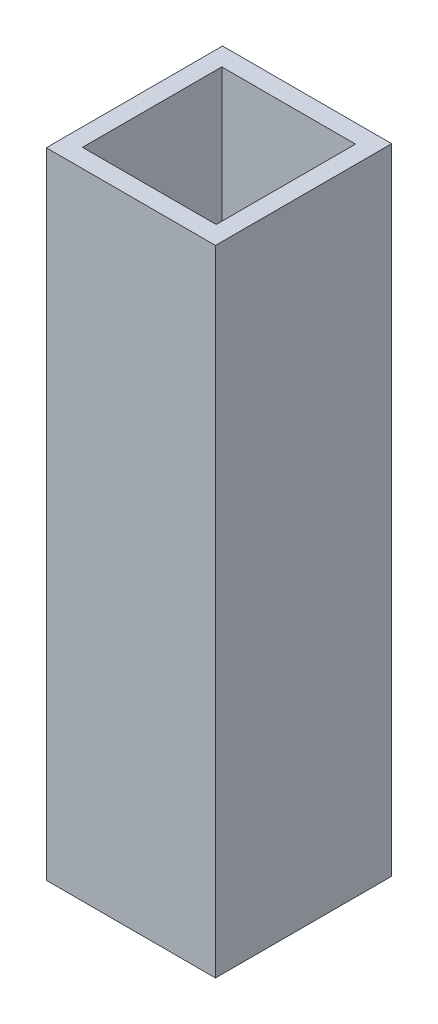
ISO-10303-21;
HEADER;
FILE_DESCRIPTION(('STEP AP214'),'2;1');
FILE_NAME('part.step','',(''),(''),'','','');
FILE_SCHEMA(('AUTOMOTIVE_DESIGN { 1 0 10303 214 1 1 1 1 }'));
ENDSEC;
DATA;
#1=APPLICATION_CONTEXT('core data for automotive mechanical design processes');
#2=APPLICATION_PROTOCOL_DEFINITION('international standard','automotive_design',2000,#1);
#3=PRODUCT_CONTEXT('',#1,'mechanical');
#4=PRODUCT('Part','Part','',(#3));
#5=PRODUCT_RELATED_PRODUCT_CATEGORY('part','',(#4));
#6=PRODUCT_DEFINITION_FORMATION('','',#4);
#7=PRODUCT_DEFINITION_CONTEXT('part definition',#1,'design');
#8=PRODUCT_DEFINITION('design','',#6,#7);
#9=PRODUCT_DEFINITION_SHAPE('','',#8);
#10=(LENGTH_UNIT() NAMED_UNIT(*) SI_UNIT(.MILLI.,.METRE.));
#11=(NAMED_UNIT(*) PLANE_ANGLE_UNIT() SI_UNIT($,.RADIAN.));
#12=(NAMED_UNIT(*) SI_UNIT($,.STERADIAN.) SOLID_ANGLE_UNIT());
#13=UNCERTAINTY_MEASURE_WITH_UNIT(LENGTH_MEASURE(1.E-05),#10,'distance_accuracy_value','');
#14=(GEOMETRIC_REPRESENTATION_CONTEXT(3) GLOBAL_UNCERTAINTY_ASSIGNED_CONTEXT((#13)) GLOBAL_UNIT_ASSIGNED_CONTEXT((#10,
#11,#12)) REPRESENTATION_CONTEXT('',''));
#15=CARTESIAN_POINT('',(0.,0.,0.));
#16=DIRECTION('',(0.,0.,1.));
#17=DIRECTION('',(1.,0.,0.));
#18=AXIS2_PLACEMENT_3D('',#15,#16,#17);
#19=CARTESIAN_POINT('',(0.,45.,0.));
#20=DIRECTION('',(0.,-1.,0.));
#21=DIRECTION('',(0.,0.,-1.));
#22=AXIS2_PLACEMENT_3D('',#19,#20,#21);
#23=PLANE('',#22);
#24=DIRECTION('',(0.,0.,-1.));
#25=VECTOR('',#24,1.);
#26=CARTESIAN_POINT('',(6.,45.,6.25));
#27=LINE('',#26,#25);
#28=CARTESIAN_POINT('',(6.,45.,6.25));
#29=VERTEX_POINT('',#28);
#30=CARTESIAN_POINT('',(6.,45.,-6.25));
#31=VERTEX_POINT('',#30);
#32=EDGE_CURVE('E143',#29,#31,#27,.T.);
#33=ORIENTED_EDGE('',*,*,#32,.T.);
#34=DIRECTION('',(-1.,0.,0.));
#35=VECTOR('',#34,1.);
#36=CARTESIAN_POINT('',(-6.,45.,-6.25));
#37=LINE('',#36,#35);
#38=CARTESIAN_POINT('',(-6.,45.,-6.25));
#39=VERTEX_POINT('',#38);
#40=EDGE_CURVE('E146',#31,#39,#37,.T.);
#41=ORIENTED_EDGE('',*,*,#40,.T.);
#42=DIRECTION('',(0.,0.,1.));
#43=VECTOR('',#42,1.);
#44=CARTESIAN_POINT('',(-6.,45.,6.25));
#45=LINE('',#44,#43);
#46=CARTESIAN_POINT('',(-6.,45.,6.25));
#47=VERTEX_POINT('',#46);
#48=EDGE_CURVE('E149',#39,#47,#45,.T.);
#49=ORIENTED_EDGE('',*,*,#48,.T.);
#50=DIRECTION('',(1.,0.,0.));
#51=VECTOR('',#50,1.);
#52=CARTESIAN_POINT('',(-6.,45.,6.25));
#53=LINE('',#52,#51);
#54=EDGE_CURVE('E151',#47,#29,#53,.T.);
#55=ORIENTED_EDGE('',*,*,#54,.T.);
#56=EDGE_LOOP('',(#33,#41,#49,#55));
#57=FACE_BOUND('',#56,.T.);
#58=DIRECTION('',(0.,0.,-1.));
#59=VECTOR('',#58,1.);
#60=CARTESIAN_POINT('',(4.74160046622516,45.,4.93916715231788));
#61=LINE('',#60,#59);
#62=CARTESIAN_POINT('',(4.74160046622516,45.,4.93916715231788));
#63=VERTEX_POINT('',#62);
#64=CARTESIAN_POINT('',(4.74160046622516,45.,-4.93916715231788));
#65=VERTEX_POINT('',#64);
#66=EDGE_CURVE('E130',#63,#65,#61,.T.);
#67=ORIENTED_EDGE('',*,*,#66,.F.);
#68=DIRECTION('',(1.,0.,0.));
#69=VECTOR('',#68,1.);
#70=CARTESIAN_POINT('',(-4.74160046622516,45.,4.93916715231788));
#71=LINE('',#70,#69);
#72=CARTESIAN_POINT('',(-4.74160046622516,45.,4.93916715231788));
#73=VERTEX_POINT('',#72);
#74=EDGE_CURVE('E114',#73,#63,#71,.T.);
#75=ORIENTED_EDGE('',*,*,#74,.F.);
#76=DIRECTION('',(0.,0.,1.));
#77=VECTOR('',#76,1.);
#78=CARTESIAN_POINT('',(-4.74160046622516,45.,4.93916715231788));
#79=LINE('',#78,#77);
#80=CARTESIAN_POINT('',(-4.74160046622516,45.,-4.93916715231788));
#81=VERTEX_POINT('',#80);
#82=EDGE_CURVE('E134',#81,#73,#79,.T.);
#83=ORIENTED_EDGE('',*,*,#82,.F.);
#84=DIRECTION('',(-1.,0.,0.));
#85=VECTOR('',#84,1.);
#86=CARTESIAN_POINT('',(-4.74160046622516,45.,-4.93916715231788));
#87=LINE('',#86,#85);
#88=EDGE_CURVE('E132',#65,#81,#87,.T.);
#89=ORIENTED_EDGE('',*,*,#88,.F.);
#90=EDGE_LOOP('',(#67,#75,#83,#89));
#91=FACE_BOUND('',#90,.T.);
#92=ADVANCED_FACE('F41',(#57,#91),#23,.F.);
#93=CARTESIAN_POINT('',(0.,0.,0.));
#94=DIRECTION('',(0.,-1.,0.));
#95=DIRECTION('',(0.,0.,-1.));
#96=AXIS2_PLACEMENT_3D('',#93,#94,#95);
#97=PLANE('',#96);
#98=DIRECTION('',(0.,0.,-1.));
#99=VECTOR('',#98,1.);
#100=CARTESIAN_POINT('',(6.,0.,6.25));
#101=LINE('',#100,#99);
#102=CARTESIAN_POINT('',(6.,0.,6.25));
#103=VERTEX_POINT('',#102);
#104=CARTESIAN_POINT('',(6.,0.,-6.25));
#105=VERTEX_POINT('',#104);
#106=EDGE_CURVE('E142',#103,#105,#101,.T.);
#107=ORIENTED_EDGE('',*,*,#106,.F.);
#108=DIRECTION('',(1.,0.,0.));
#109=VECTOR('',#108,1.);
#110=CARTESIAN_POINT('',(-6.,0.,6.25));
#111=LINE('',#110,#109);
#112=CARTESIAN_POINT('',(-6.,0.,6.25));
#113=VERTEX_POINT('',#112);
#114=EDGE_CURVE('E147',#113,#103,#111,.T.);
#115=ORIENTED_EDGE('',*,*,#114,.F.);
#116=DIRECTION('',(0.,0.,1.));
#117=VECTOR('',#116,1.);
#118=CARTESIAN_POINT('',(-6.,0.,6.25));
#119=LINE('',#118,#117);
#120=CARTESIAN_POINT('',(-6.,0.,-6.25));
#121=VERTEX_POINT('',#120);
#122=EDGE_CURVE('E158',#121,#113,#119,.T.);
#123=ORIENTED_EDGE('',*,*,#122,.F.);
#124=DIRECTION('',(-1.,0.,0.));
#125=VECTOR('',#124,1.);
#126=CARTESIAN_POINT('',(-6.,0.,-6.25));
#127=LINE('',#126,#125);
#128=EDGE_CURVE('E156',#105,#121,#127,.T.);
#129=ORIENTED_EDGE('',*,*,#128,.F.);
#130=EDGE_LOOP('',(#107,#115,#123,#129));
#131=FACE_BOUND('',#130,.T.);
#132=ADVANCED_FACE('F176',(#131),#97,.T.);
#133=CARTESIAN_POINT('',(6.,45.,6.25));
#134=DIRECTION('',(-1.,0.,0.));
#135=DIRECTION('',(0.,0.,1.));
#136=AXIS2_PLACEMENT_3D('',#133,#134,#135);
#137=PLANE('',#136);
#138=ORIENTED_EDGE('',*,*,#106,.T.);
#139=DIRECTION('',(0.,-1.,0.));
#140=VECTOR('',#139,1.);
#141=CARTESIAN_POINT('',(6.,45.,-6.25));
#142=LINE('',#141,#140);
#143=EDGE_CURVE('E11',#31,#105,#142,.T.);
#144=ORIENTED_EDGE('',*,*,#143,.F.);
#145=ORIENTED_EDGE('',*,*,#32,.F.);
#146=DIRECTION('',(0.,-1.,0.));
#147=VECTOR('',#146,1.);
#148=CARTESIAN_POINT('',(6.,45.,6.25));
#149=LINE('',#148,#147);
#150=EDGE_CURVE('E153',#29,#103,#149,.T.);
#151=ORIENTED_EDGE('',*,*,#150,.T.);
#152=EDGE_LOOP('',(#138,#144,#145,#151));
#153=FACE_BOUND('',#152,.T.);
#154=ADVANCED_FACE('F43',(#153),#137,.F.);
#155=CARTESIAN_POINT('',(-6.,45.,-6.25));
#156=DIRECTION('',(0.,0.,1.));
#157=DIRECTION('',(1.,0.,0.));
#158=AXIS2_PLACEMENT_3D('',#155,#156,#157);
#159=PLANE('',#158);
#160=ORIENTED_EDGE('',*,*,#128,.T.);
#161=DIRECTION('',(0.,-1.,0.));
#162=VECTOR('',#161,1.);
#163=CARTESIAN_POINT('',(-6.,45.,-6.25));
#164=LINE('',#163,#162);
#165=EDGE_CURVE('E49',#39,#121,#164,.T.);
#166=ORIENTED_EDGE('',*,*,#165,.F.);
#167=ORIENTED_EDGE('',*,*,#40,.F.);
#168=ORIENTED_EDGE('',*,*,#143,.T.);
#169=EDGE_LOOP('',(#160,#166,#167,#168));
#170=FACE_BOUND('',#169,.T.);
#171=ADVANCED_FACE('F186',(#170),#159,.F.);
#172=CARTESIAN_POINT('',(-6.,45.,6.25));
#173=DIRECTION('',(1.,0.,0.));
#174=DIRECTION('',(0.,0.,-1.));
#175=AXIS2_PLACEMENT_3D('',#172,#173,#174);
#176=PLANE('',#175);
#177=ORIENTED_EDGE('',*,*,#122,.T.);
#178=DIRECTION('',(0.,-1.,0.));
#179=VECTOR('',#178,1.);
#180=CARTESIAN_POINT('',(-6.,45.,6.25));
#181=LINE('',#180,#179);
#182=EDGE_CURVE('E163',#47,#113,#181,.T.);
#183=ORIENTED_EDGE('',*,*,#182,.F.);
#184=ORIENTED_EDGE('',*,*,#48,.F.);
#185=ORIENTED_EDGE('',*,*,#165,.T.);
#186=EDGE_LOOP('',(#177,#183,#184,#185));
#187=FACE_BOUND('',#186,.T.);
#188=ADVANCED_FACE('F170',(#187),#176,.F.);
#189=CARTESIAN_POINT('',(-6.,45.,6.25));
#190=DIRECTION('',(0.,0.,-1.));
#191=DIRECTION('',(-1.,0.,0.));
#192=AXIS2_PLACEMENT_3D('',#189,#190,#191);
#193=PLANE('',#192);
#194=ORIENTED_EDGE('',*,*,#114,.T.);
#195=ORIENTED_EDGE('',*,*,#150,.F.);
#196=ORIENTED_EDGE('',*,*,#54,.F.);
#197=ORIENTED_EDGE('',*,*,#182,.T.);
#198=EDGE_LOOP('',(#194,#195,#196,#197));
#199=FACE_BOUND('',#198,.T.);
#200=ADVANCED_FACE('F179',(#199),#193,.F.);
#201=CARTESIAN_POINT('',(4.74160046622516,45.,4.93916715231788));
#202=DIRECTION('',(-1.,0.,0.));
#203=DIRECTION('',(0.,0.,1.));
#204=AXIS2_PLACEMENT_3D('',#201,#202,#203);
#205=PLANE('',#204);
#206=DIRECTION('',(0.,0.,-1.));
#207=VECTOR('',#206,1.);
#208=CARTESIAN_POINT('',(4.74160046622516,2.,0.));
#209=LINE('',#208,#207);
#210=CARTESIAN_POINT('',(4.74160046622516,2.,4.93916715231788));
#211=VERTEX_POINT('',#210);
#212=CARTESIAN_POINT('',(4.74160046622516,2.00000000000002,-4.93916715231788));
#213=VERTEX_POINT('',#212);
#214=EDGE_CURVE('E120',#211,#213,#209,.T.);
#215=ORIENTED_EDGE('',*,*,#214,.F.);
#216=DIRECTION('',(0.,-1.,0.));
#217=VECTOR('',#216,1.);
#218=CARTESIAN_POINT('',(4.74160046622516,45.,4.93916715231788));
#219=LINE('',#218,#217);
#220=EDGE_CURVE('E108',#63,#211,#219,.T.);
#221=ORIENTED_EDGE('',*,*,#220,.F.);
#222=ORIENTED_EDGE('',*,*,#66,.T.);
#223=DIRECTION('',(0.,-1.,0.));
#224=VECTOR('',#223,1.);
#225=CARTESIAN_POINT('',(4.74160046622516,45.,-4.93916715231788));
#226=LINE('',#225,#224);
#227=EDGE_CURVE('E122',#65,#213,#226,.T.);
#228=ORIENTED_EDGE('',*,*,#227,.T.);
#229=EDGE_LOOP('',(#215,#221,#222,#228));
#230=FACE_BOUND('',#229,.T.);
#231=ADVANCED_FACE('F121',(#230),#205,.T.);
#232=CARTESIAN_POINT('',(-4.74160046622516,45.,-4.93916715231788));
#233=DIRECTION('',(0.,0.,1.));
#234=DIRECTION('',(1.,0.,0.));
#235=AXIS2_PLACEMENT_3D('',#232,#233,#234);
#236=PLANE('',#235);
#237=DIRECTION('',(1.,0.,0.));
#238=VECTOR('',#237,1.);
#239=CARTESIAN_POINT('',(0.,2.,-4.93916715231788));
#240=LINE('',#239,#238);
#241=CARTESIAN_POINT('',(-4.74160046622516,2.00000000000002,-4.93916715231788));
#242=VERTEX_POINT('',#241);
#243=EDGE_CURVE('E56',#242,#213,#240,.T.);
#244=ORIENTED_EDGE('',*,*,#243,.T.);
#245=ORIENTED_EDGE('',*,*,#227,.F.);
#246=ORIENTED_EDGE('',*,*,#88,.T.);
#247=DIRECTION('',(0.,-1.,0.));
#248=VECTOR('',#247,1.);
#249=CARTESIAN_POINT('',(-4.74160046622516,45.,-4.93916715231788));
#250=LINE('',#249,#248);
#251=EDGE_CURVE('E139',#81,#242,#250,.T.);
#252=ORIENTED_EDGE('',*,*,#251,.T.);
#253=EDGE_LOOP('',(#244,#245,#246,#252));
#254=FACE_BOUND('',#253,.T.);
#255=ADVANCED_FACE('F206',(#254),#236,.T.);
#256=CARTESIAN_POINT('',(-4.74160046622516,45.,4.93916715231788));
#257=DIRECTION('',(1.,0.,0.));
#258=DIRECTION('',(0.,0.,-1.));
#259=AXIS2_PLACEMENT_3D('',#256,#257,#258);
#260=PLANE('',#259);
#261=DIRECTION('',(0.,0.,-1.));
#262=VECTOR('',#261,1.);
#263=CARTESIAN_POINT('',(-4.74160046622516,2.,0.));
#264=LINE('',#263,#262);
#265=CARTESIAN_POINT('',(-4.74160046622516,2.00000000000002,4.93916715231788));
#266=VERTEX_POINT('',#265);
#267=EDGE_CURVE('E64',#266,#242,#264,.T.);
#268=ORIENTED_EDGE('',*,*,#267,.T.);
#269=ORIENTED_EDGE('',*,*,#251,.F.);
#270=ORIENTED_EDGE('',*,*,#82,.T.);
#271=DIRECTION('',(0.,-1.,0.));
#272=VECTOR('',#271,1.);
#273=CARTESIAN_POINT('',(-4.74160046622516,45.,4.93916715231788));
#274=LINE('',#273,#272);
#275=EDGE_CURVE('E117',#73,#266,#274,.T.);
#276=ORIENTED_EDGE('',*,*,#275,.T.);
#277=EDGE_LOOP('',(#268,#269,#270,#276));
#278=FACE_BOUND('',#277,.T.);
#279=ADVANCED_FACE('F210',(#278),#260,.T.);
#280=CARTESIAN_POINT('',(-4.74160046622516,45.,4.93916715231788));
#281=DIRECTION('',(0.,0.,-1.));
#282=DIRECTION('',(-1.,0.,0.));
#283=AXIS2_PLACEMENT_3D('',#280,#281,#282);
#284=PLANE('',#283);
#285=DIRECTION('',(1.,0.,0.));
#286=VECTOR('',#285,1.);
#287=CARTESIAN_POINT('',(0.,2.,4.93916715231788));
#288=LINE('',#287,#286);
#289=EDGE_CURVE('E112',#266,#211,#288,.T.);
#290=ORIENTED_EDGE('',*,*,#289,.F.);
#291=ORIENTED_EDGE('',*,*,#275,.F.);
#292=ORIENTED_EDGE('',*,*,#74,.T.);
#293=ORIENTED_EDGE('',*,*,#220,.T.);
#294=EDGE_LOOP('',(#290,#291,#292,#293));
#295=FACE_BOUND('',#294,.T.);
#296=ADVANCED_FACE('F110',(#295),#284,.T.);
#297=CARTESIAN_POINT('',(0.,2.,0.));
#298=DIRECTION('',(0.,1.,0.));
#299=DIRECTION('',(0.,0.,1.));
#300=AXIS2_PLACEMENT_3D('',#297,#298,#299);
#301=PLANE('',#300);
#302=ORIENTED_EDGE('',*,*,#289,.T.);
#303=ORIENTED_EDGE('',*,*,#214,.T.);
#304=ORIENTED_EDGE('',*,*,#243,.F.);
#305=ORIENTED_EDGE('',*,*,#267,.F.);
#306=EDGE_LOOP('',(#302,#303,#304,#305));
#307=FACE_BOUND('',#306,.T.);
#308=ADVANCED_FACE('F125',(#307),#301,.T.);
#309=CLOSED_SHELL('',(#92,#132,#154,#171,#188,#200,#231,#255,#279,#296,#308));
#310=MANIFOLD_SOLID_BREP('B2',#309);
#311=ADVANCED_BREP_SHAPE_REPRESENTATION('',(#18,#310),#14);
#312=SHAPE_DEFINITION_REPRESENTATION(#9,#311);
ENDSEC;
END-ISO-10303-21;
